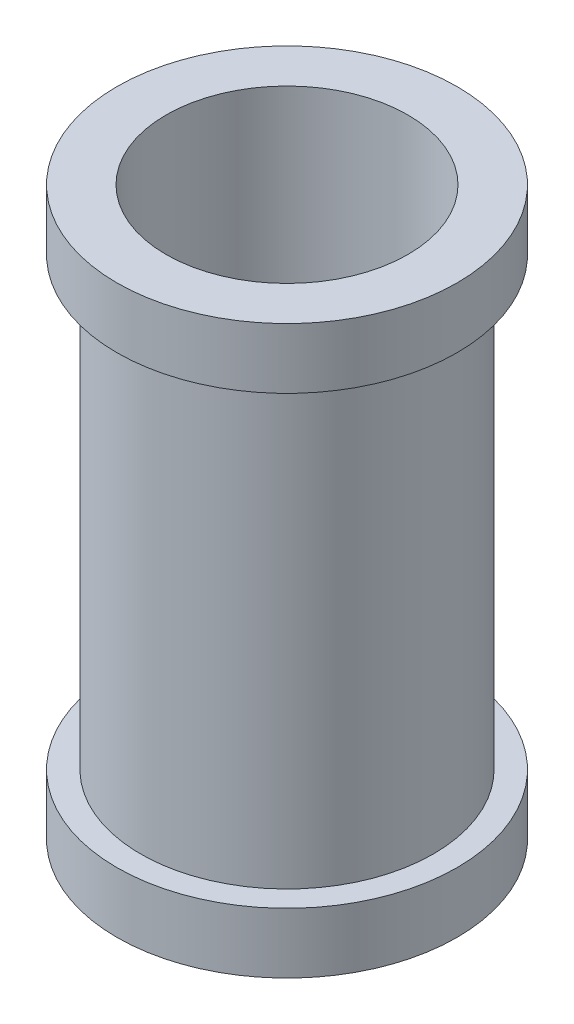
ISO-10303-21;
HEADER;
FILE_DESCRIPTION(('STEP AP214'),'2;1');
FILE_NAME('part.step','',(''),(''),'','','');
FILE_SCHEMA(('AUTOMOTIVE_DESIGN { 1 0 10303 214 1 1 1 1 }'));
ENDSEC;
DATA;
#1=APPLICATION_CONTEXT('core data for automotive mechanical design processes');
#2=APPLICATION_PROTOCOL_DEFINITION('international standard','automotive_design',2000,#1);
#3=PRODUCT_CONTEXT('',#1,'mechanical');
#4=PRODUCT('Part','Part','',(#3));
#5=PRODUCT_RELATED_PRODUCT_CATEGORY('part','',(#4));
#6=PRODUCT_DEFINITION_FORMATION('','',#4);
#7=PRODUCT_DEFINITION_CONTEXT('part definition',#1,'design');
#8=PRODUCT_DEFINITION('design','',#6,#7);
#9=PRODUCT_DEFINITION_SHAPE('','',#8);
#10=(LENGTH_UNIT() NAMED_UNIT(*) SI_UNIT(.MILLI.,.METRE.));
#11=(NAMED_UNIT(*) PLANE_ANGLE_UNIT() SI_UNIT($,.RADIAN.));
#12=(NAMED_UNIT(*) SI_UNIT($,.STERADIAN.) SOLID_ANGLE_UNIT());
#13=UNCERTAINTY_MEASURE_WITH_UNIT(LENGTH_MEASURE(1.E-05),#10,'distance_accuracy_value','');
#14=(GEOMETRIC_REPRESENTATION_CONTEXT(3) GLOBAL_UNCERTAINTY_ASSIGNED_CONTEXT((#13)) GLOBAL_UNIT_ASSIGNED_CONTEXT((#10,
#11,#12)) REPRESENTATION_CONTEXT('',''));
#15=CARTESIAN_POINT('',(0.,0.,0.));
#16=DIRECTION('',(0.,0.,1.));
#17=DIRECTION('',(1.,0.,0.));
#18=AXIS2_PLACEMENT_3D('',#15,#16,#17);
#19=CARTESIAN_POINT('',(28.575,85.09,-28.575));
#20=DIRECTION('',(0.,1.,0.));
#21=DIRECTION('',(-1.,0.,0.));
#22=AXIS2_PLACEMENT_3D('',#19,#20,#21);
#23=PLANE('',#22);
#24=CARTESIAN_POINT('',(0.,85.09,0.));
#25=DIRECTION('',(0.,1.,0.));
#26=DIRECTION('',(-1.,0.,0.));
#27=AXIS2_PLACEMENT_3D('',#24,#25,#26);
#28=CIRCLE('',#27,28.575);
#29=CARTESIAN_POINT('',(-28.575,85.09,0.));
#30=VERTEX_POINT('',#29);
#31=EDGE_CURVE('E44',#30,#30,#28,.F.);
#32=ORIENTED_EDGE('',*,*,#31,.T.);
#33=EDGE_LOOP('',(#32));
#34=FACE_BOUND('',#33,.T.);
#35=CARTESIAN_POINT('',(0.,85.09,0.));
#36=DIRECTION('',(0.,1.,0.));
#37=DIRECTION('',(-1.,0.,0.));
#38=AXIS2_PLACEMENT_3D('',#35,#36,#37);
#39=CIRCLE('',#38,24.60625);
#40=CARTESIAN_POINT('',(-24.60625,85.09,0.));
#41=VERTEX_POINT('',#40);
#42=EDGE_CURVE('E10',#41,#41,#39,.F.);
#43=ORIENTED_EDGE('',*,*,#42,.F.);
#44=EDGE_LOOP('',(#43));
#45=FACE_BOUND('',#44,.T.);
#46=ADVANCED_FACE('F37',(#34,#45),#23,.F.);
#47=CARTESIAN_POINT('',(0.,95.25,0.));
#48=DIRECTION('',(0.,-1.,0.));
#49=DIRECTION('',(0.,0.,-1.));
#50=AXIS2_PLACEMENT_3D('',#47,#48,#49);
#51=CYLINDRICAL_SURFACE('',#50,20.32);
#52=CARTESIAN_POINT('',(0.,95.25,0.));
#53=DIRECTION('',(0.,1.,0.));
#54=DIRECTION('',(0.,0.,1.));
#55=AXIS2_PLACEMENT_3D('',#52,#53,#54);
#56=CIRCLE('',#55,20.32);
#57=CARTESIAN_POINT('',(0.,95.25,20.32));
#58=VERTEX_POINT('',#57);
#59=EDGE_CURVE('E53',#58,#58,#56,.T.);
#60=ORIENTED_EDGE('',*,*,#59,.T.);
#61=EDGE_LOOP('',(#60));
#62=FACE_BOUND('',#61,.T.);
#63=CARTESIAN_POINT('',(0.,0.,0.));
#64=DIRECTION('',(0.,1.,0.));
#65=DIRECTION('',(0.,0.,1.));
#66=AXIS2_PLACEMENT_3D('',#63,#64,#65);
#67=CIRCLE('',#66,20.32);
#68=CARTESIAN_POINT('',(0.,0.,20.32));
#69=VERTEX_POINT('',#68);
#70=EDGE_CURVE('E66',#69,#69,#67,.T.);
#71=ORIENTED_EDGE('',*,*,#70,.F.);
#72=EDGE_LOOP('',(#71));
#73=FACE_BOUND('',#72,.T.);
#74=ADVANCED_FACE('F93',(#62,#73),#51,.F.);
#75=CARTESIAN_POINT('',(0.,95.25,0.));
#76=DIRECTION('',(0.,1.,0.));
#77=DIRECTION('',(0.,0.,1.));
#78=AXIS2_PLACEMENT_3D('',#75,#76,#77);
#79=PLANE('',#78);
#80=ORIENTED_EDGE('',*,*,#59,.F.);
#81=EDGE_LOOP('',(#80));
#82=FACE_BOUND('',#81,.T.);
#83=CARTESIAN_POINT('',(0.,95.25,0.));
#84=DIRECTION('',(0.,1.,0.));
#85=DIRECTION('',(0.,0.,1.));
#86=AXIS2_PLACEMENT_3D('',#83,#84,#85);
#87=CIRCLE('',#86,28.575);
#88=CARTESIAN_POINT('',(0.,95.25,28.575));
#89=VERTEX_POINT('',#88);
#90=EDGE_CURVE('E48',#89,#89,#87,.T.);
#91=ORIENTED_EDGE('',*,*,#90,.T.);
#92=EDGE_LOOP('',(#91));
#93=FACE_BOUND('',#92,.T.);
#94=ADVANCED_FACE('F98',(#82,#93),#79,.T.);
#95=CARTESIAN_POINT('',(0.,-80.8223050896224,0.));
#96=DIRECTION('',(0.,1.,0.));
#97=DIRECTION('',(0.,0.,1.));
#98=AXIS2_PLACEMENT_3D('',#95,#96,#97);
#99=CYLINDRICAL_SURFACE('',#98,28.575);
#100=ORIENTED_EDGE('',*,*,#31,.F.);
#101=EDGE_LOOP('',(#100));
#102=FACE_BOUND('',#101,.T.);
#103=ORIENTED_EDGE('',*,*,#90,.F.);
#104=EDGE_LOOP('',(#103));
#105=FACE_BOUND('',#104,.T.);
#106=ADVANCED_FACE('F39',(#102,#105),#99,.T.);
#107=CARTESIAN_POINT('',(0.,154.686984938286,0.));
#108=DIRECTION('',(0.,-1.,0.));
#109=DIRECTION('',(1.,0.,0.));
#110=AXIS2_PLACEMENT_3D('',#107,#108,#109);
#111=CYLINDRICAL_SURFACE('',#110,24.60625);
#112=CARTESIAN_POINT('',(0.,10.16,0.));
#113=DIRECTION('',(0.,1.,0.));
#114=DIRECTION('',(-1.,0.,0.));
#115=AXIS2_PLACEMENT_3D('',#112,#113,#114);
#116=CIRCLE('',#115,24.60625);
#117=CARTESIAN_POINT('',(-24.60625,10.16,0.));
#118=VERTEX_POINT('',#117);
#119=EDGE_CURVE('E56',#118,#118,#116,.T.);
#120=ORIENTED_EDGE('',*,*,#119,.T.);
#121=EDGE_LOOP('',(#120));
#122=FACE_BOUND('',#121,.T.);
#123=ORIENTED_EDGE('',*,*,#42,.T.);
#124=EDGE_LOOP('',(#123));
#125=FACE_BOUND('',#124,.T.);
#126=ADVANCED_FACE('F89',(#122,#125),#111,.T.);
#127=CARTESIAN_POINT('',(0.,0.,0.));
#128=DIRECTION('',(0.,1.,0.));
#129=DIRECTION('',(0.,0.,1.));
#130=AXIS2_PLACEMENT_3D('',#127,#128,#129);
#131=PLANE('',#130);
#132=ORIENTED_EDGE('',*,*,#70,.T.);
#133=EDGE_LOOP('',(#132));
#134=FACE_BOUND('',#133,.T.);
#135=CARTESIAN_POINT('',(0.,0.,0.));
#136=DIRECTION('',(0.,1.,0.));
#137=DIRECTION('',(0.,0.,1.));
#138=AXIS2_PLACEMENT_3D('',#135,#136,#137);
#139=CIRCLE('',#138,28.575);
#140=CARTESIAN_POINT('',(0.,0.,28.575));
#141=VERTEX_POINT('',#140);
#142=EDGE_CURVE('E70',#141,#141,#139,.F.);
#143=ORIENTED_EDGE('',*,*,#142,.T.);
#144=EDGE_LOOP('',(#143));
#145=FACE_BOUND('',#144,.T.);
#146=ADVANCED_FACE('F76',(#134,#145),#131,.F.);
#147=CARTESIAN_POINT('',(0.,-80.8223050896224,0.));
#148=DIRECTION('',(0.,1.,0.));
#149=DIRECTION('',(0.,0.,1.));
#150=AXIS2_PLACEMENT_3D('',#147,#148,#149);
#151=CYLINDRICAL_SURFACE('',#150,28.575);
#152=CARTESIAN_POINT('',(0.,10.16,0.));
#153=DIRECTION('',(0.,-1.,0.));
#154=DIRECTION('',(1.,0.,0.));
#155=AXIS2_PLACEMENT_3D('',#152,#153,#154);
#156=CIRCLE('',#155,28.575);
#157=CARTESIAN_POINT('',(28.575,10.16,0.));
#158=VERTEX_POINT('',#157);
#159=EDGE_CURVE('E62',#158,#158,#156,.F.);
#160=ORIENTED_EDGE('',*,*,#159,.F.);
#161=EDGE_LOOP('',(#160));
#162=FACE_BOUND('',#161,.T.);
#163=ORIENTED_EDGE('',*,*,#142,.F.);
#164=EDGE_LOOP('',(#163));
#165=FACE_BOUND('',#164,.T.);
#166=ADVANCED_FACE('F78',(#162,#165),#151,.T.);
#167=CARTESIAN_POINT('',(28.575,10.16,-28.575));
#168=DIRECTION('',(0.,-1.,0.));
#169=DIRECTION('',(1.,0.,0.));
#170=AXIS2_PLACEMENT_3D('',#167,#168,#169);
#171=PLANE('',#170);
#172=ORIENTED_EDGE('',*,*,#119,.F.);
#173=EDGE_LOOP('',(#172));
#174=FACE_BOUND('',#173,.T.);
#175=ORIENTED_EDGE('',*,*,#159,.T.);
#176=EDGE_LOOP('',(#175));
#177=FACE_BOUND('',#176,.T.);
#178=ADVANCED_FACE('F80',(#174,#177),#171,.F.);
#179=CLOSED_SHELL('',(#46,#74,#94,#106,#126,#146,#166,#178));
#180=MANIFOLD_SOLID_BREP('B2',#179);
#181=ADVANCED_BREP_SHAPE_REPRESENTATION('',(#18,#180),#14);
#182=SHAPE_DEFINITION_REPRESENTATION(#9,#181);
ENDSEC;
END-ISO-10303-21;
